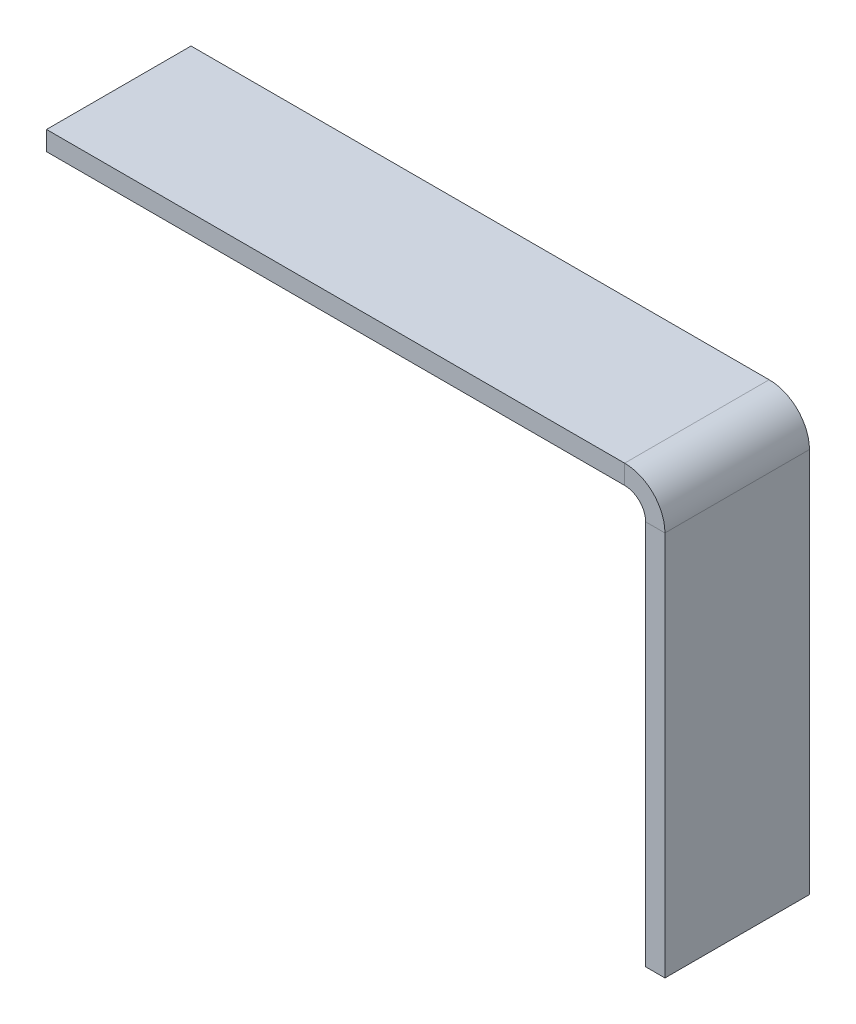
ISO-10303-21;
HEADER;
FILE_DESCRIPTION(('STEP AP214'),'2;1');
FILE_NAME('part.step','',(''),(''),'','','');
FILE_SCHEMA(('AUTOMOTIVE_DESIGN { 1 0 10303 214 1 1 1 1 }'));
ENDSEC;
DATA;
#1=APPLICATION_CONTEXT('core data for automotive mechanical design processes');
#2=APPLICATION_PROTOCOL_DEFINITION('international standard','automotive_design',2000,#1);
#3=PRODUCT_CONTEXT('',#1,'mechanical');
#4=PRODUCT('Part','Part','',(#3));
#5=PRODUCT_RELATED_PRODUCT_CATEGORY('part','',(#4));
#6=PRODUCT_DEFINITION_FORMATION('','',#4);
#7=PRODUCT_DEFINITION_CONTEXT('part definition',#1,'design');
#8=PRODUCT_DEFINITION('design','',#6,#7);
#9=PRODUCT_DEFINITION_SHAPE('','',#8);
#10=(LENGTH_UNIT() NAMED_UNIT(*) SI_UNIT(.MILLI.,.METRE.));
#11=(NAMED_UNIT(*) PLANE_ANGLE_UNIT() SI_UNIT($,.RADIAN.));
#12=(NAMED_UNIT(*) SI_UNIT($,.STERADIAN.) SOLID_ANGLE_UNIT());
#13=UNCERTAINTY_MEASURE_WITH_UNIT(LENGTH_MEASURE(1.E-05),#10,'distance_accuracy_value','');
#14=(GEOMETRIC_REPRESENTATION_CONTEXT(3) GLOBAL_UNCERTAINTY_ASSIGNED_CONTEXT((#13)) GLOBAL_UNIT_ASSIGNED_CONTEXT((#10,
#11,#12)) REPRESENTATION_CONTEXT('',''));
#15=CARTESIAN_POINT('',(0.,0.,0.));
#16=DIRECTION('',(0.,0.,1.));
#17=DIRECTION('',(1.,0.,0.));
#18=AXIS2_PLACEMENT_3D('',#15,#16,#17);
#19=CARTESIAN_POINT('',(0.00928047136647403,-121.697706723207,0.));
#20=DIRECTION('',(-0.999999997139426,-7.56382757487755E-05,0.));
#21=DIRECTION('',(7.56382757487755E-05,-0.999999997139426,0.));
#22=AXIS2_PLACEMENT_3D('',#19,#20,#21);
#23=PLANE('',#22);
#24=DIRECTION('',(-7.56382757487755E-05,0.999999997139426,0.));
#25=VECTOR('',#24,1.);
#26=CARTESIAN_POINT('',(0.00928047136647403,-121.697706723207,15.));
#27=LINE('',#26,#25);
#28=CARTESIAN_POINT('',(7.58099104186671E-05,-0.00453830278984019,15.));
#29=VERTEX_POINT('',#28);
#30=CARTESIAN_POINT('',(-7.54666410751614E-05,1.995461691489,15.));
#31=VERTEX_POINT('',#30);
#32=EDGE_CURVE('E205',#29,#31,#27,.T.);
#33=ORIENTED_EDGE('',*,*,#32,.T.);
#34=DIRECTION('',(0.,0.,1.));
#35=VECTOR('',#34,1.);
#36=CARTESIAN_POINT('',(-7.54666410612836E-05,1.995461691489,0.));
#37=LINE('',#36,#35);
#38=CARTESIAN_POINT('',(-7.54666410751614E-05,1.995461691489,0.));
#39=VERTEX_POINT('',#38);
#40=EDGE_CURVE('E195',#39,#31,#37,.T.);
#41=ORIENTED_EDGE('',*,*,#40,.F.);
#42=DIRECTION('',(-7.56382757487755E-05,0.999999997139426,0.));
#43=VECTOR('',#42,1.);
#44=CARTESIAN_POINT('',(0.00928047136647403,-121.697706723207,0.));
#45=LINE('',#44,#43);
#46=CARTESIAN_POINT('',(7.58099104186671E-05,-0.00453830278984019,0.));
#47=VERTEX_POINT('',#46);
#48=EDGE_CURVE('E103',#47,#39,#45,.T.);
#49=ORIENTED_EDGE('',*,*,#48,.F.);
#50=DIRECTION('',(0.,0.,1.));
#51=VECTOR('',#50,1.);
#52=CARTESIAN_POINT('',(7.58099104186671E-05,-0.00453830278984019,0.));
#53=LINE('',#52,#51);
#54=EDGE_CURVE('E132',#47,#29,#53,.T.);
#55=ORIENTED_EDGE('',*,*,#54,.T.);
#56=EDGE_LOOP('',(#33,#41,#49,#55));
#57=FACE_BOUND('',#56,.T.);
#58=ADVANCED_FACE('F93',(#57),#23,.T.);
#59=CARTESIAN_POINT('',(0.00928047136648791,-121.697706723207,15.));
#60=DIRECTION('',(0.,0.,1.));
#61=DIRECTION('',(0.,1.,0.));
#62=AXIS2_PLACEMENT_3D('',#59,#60,#61);
#63=PLANE('',#62);
#64=DIRECTION('',(-7.56382757487755E-05,0.999999997139426,0.));
#65=VECTOR('',#64,1.);
#66=CARTESIAN_POINT('',(60.009280299732,-121.693168426662,15.));
#67=LINE('',#66,#65);
#68=CARTESIAN_POINT('',(60.000075638276,-6.24490693532098E-09,15.));
#69=VERTEX_POINT('',#68);
#70=CARTESIAN_POINT('',(59.9999243617245,1.99999998803395,15.));
#71=VERTEX_POINT('',#70);
#72=EDGE_CURVE('E187',#69,#71,#67,.T.);
#73=ORIENTED_EDGE('',*,*,#72,.T.);
#74=DIRECTION('',(0.999999997139426,7.56382757487756E-05,0.));
#75=VECTOR('',#74,1.);
#76=CARTESIAN_POINT('',(-7.54666410612836E-05,1.995461691489,15.));
#77=LINE('',#76,#75);
#78=EDGE_CURVE('E182',#31,#71,#77,.T.);
#79=ORIENTED_EDGE('',*,*,#78,.F.);
#80=ORIENTED_EDGE('',*,*,#32,.F.);
#81=DIRECTION('',(0.999999997139426,7.56382757487756E-05,0.));
#82=VECTOR('',#81,1.);
#83=CARTESIAN_POINT('',(7.58099104325449E-05,-0.00453830278984019,15.));
#84=LINE('',#83,#82);
#85=EDGE_CURVE('E197',#29,#69,#84,.T.);
#86=ORIENTED_EDGE('',*,*,#85,.T.);
#87=EDGE_LOOP('',(#73,#79,#80,#86));
#88=FACE_BOUND('',#87,.T.);
#89=ADVANCED_FACE('F200',(#88),#63,.T.);
#90=CARTESIAN_POINT('',(-7.54666410612836E-05,1.995461691489,0.));
#91=DIRECTION('',(-7.56382757487756E-05,0.999999997139426,0.));
#92=DIRECTION('',(0.,0.,1.));
#93=AXIS2_PLACEMENT_3D('',#90,#91,#92);
#94=PLANE('',#93);
#95=ORIENTED_EDGE('',*,*,#78,.T.);
#96=DIRECTION('',(0.,0.,-1.));
#97=VECTOR('',#96,1.);
#98=CARTESIAN_POINT('',(59.9999243617245,1.99999998803393,0.));
#99=LINE('',#98,#97);
#100=CARTESIAN_POINT('',(59.9999243617245,1.99999998803396,0.));
#101=VERTEX_POINT('',#100);
#102=EDGE_CURVE('E174',#71,#101,#99,.T.);
#103=ORIENTED_EDGE('',*,*,#102,.T.);
#104=DIRECTION('',(-0.999999997139426,-7.56382757487756E-05,0.));
#105=VECTOR('',#104,1.);
#106=CARTESIAN_POINT('',(-7.54666410612836E-05,1.995461691489,0.));
#107=LINE('',#106,#105);
#108=EDGE_CURVE('E181',#101,#39,#107,.T.);
#109=ORIENTED_EDGE('',*,*,#108,.T.);
#110=ORIENTED_EDGE('',*,*,#40,.T.);
#111=EDGE_LOOP('',(#95,#103,#109,#110));
#112=FACE_BOUND('',#111,.T.);
#113=ADVANCED_FACE('F193',(#112),#94,.T.);
#114=CARTESIAN_POINT('',(0.00928047136647403,-121.697706723207,0.));
#115=DIRECTION('',(0.,0.,-1.));
#116=DIRECTION('',(0.,-1.,0.));
#117=AXIS2_PLACEMENT_3D('',#114,#115,#116);
#118=PLANE('',#117);
#119=ORIENTED_EDGE('',*,*,#48,.T.);
#120=ORIENTED_EDGE('',*,*,#108,.F.);
#121=DIRECTION('',(-7.56382757487755E-05,0.999999997139426,0.));
#122=VECTOR('',#121,1.);
#123=CARTESIAN_POINT('',(60.009280299732,-121.693168426662,0.));
#124=LINE('',#123,#122);
#125=CARTESIAN_POINT('',(60.000075638276,-6.24490693532098E-09,0.));
#126=VERTEX_POINT('',#125);
#127=EDGE_CURVE('E210',#126,#101,#124,.T.);
#128=ORIENTED_EDGE('',*,*,#127,.F.);
#129=DIRECTION('',(-0.999999997139426,-7.56382757487756E-05,0.));
#130=VECTOR('',#129,1.);
#131=CARTESIAN_POINT('',(7.58099104186671E-05,-0.00453830278984019,0.));
#132=LINE('',#131,#130);
#133=EDGE_CURVE('E13',#126,#47,#132,.T.);
#134=ORIENTED_EDGE('',*,*,#133,.T.);
#135=EDGE_LOOP('',(#119,#120,#128,#134));
#136=FACE_BOUND('',#135,.T.);
#137=ADVANCED_FACE('F223',(#136),#118,.T.);
#138=CARTESIAN_POINT('',(7.58099104186671E-05,-0.00453830278984019,0.));
#139=DIRECTION('',(-7.56382757487756E-05,0.999999997139426,0.));
#140=DIRECTION('',(0.,0.,1.));
#141=AXIS2_PLACEMENT_3D('',#138,#139,#140);
#142=PLANE('',#141);
#143=DIRECTION('',(0.,0.,-1.));
#144=VECTOR('',#143,1.);
#145=CARTESIAN_POINT('',(60.000075638276,-6.24490736900185E-09,0.));
#146=LINE('',#145,#144);
#147=EDGE_CURVE('E97',#69,#126,#146,.T.);
#148=ORIENTED_EDGE('',*,*,#147,.F.);
#149=ORIENTED_EDGE('',*,*,#85,.F.);
#150=ORIENTED_EDGE('',*,*,#54,.F.);
#151=ORIENTED_EDGE('',*,*,#133,.F.);
#152=EDGE_LOOP('',(#148,#149,#150,#151));
#153=FACE_BOUND('',#152,.T.);
#154=ADVANCED_FACE('F95',(#153),#142,.F.);
#155=CARTESIAN_POINT('',(64.1784231260581,62.81721735461,0.));
#156=DIRECTION('',(0.999999997139426,7.56382757452962E-05,0.));
#157=DIRECTION('',(0.,0.,1.));
#158=AXIS2_PLACEMENT_3D('',#155,#156,#157);
#159=PLANE('',#158);
#160=DIRECTION('',(0.,0.,-1.));
#161=VECTOR('',#160,1.);
#162=CARTESIAN_POINT('',(64.1833396139815,-2.18278245945271,0.));
#163=LINE('',#162,#161);
#164=CARTESIAN_POINT('',(64.1833396139815,-2.18278245945271,15.));
#165=VERTEX_POINT('',#164);
#166=CARTESIAN_POINT('',(64.1833396139815,-2.18278245945271,0.));
#167=VERTEX_POINT('',#166);
#168=EDGE_CURVE('E381',#165,#167,#163,.T.);
#169=ORIENTED_EDGE('',*,*,#168,.F.);
#170=DIRECTION('',(7.56382757452962E-05,-0.999999997139426,0.));
#171=VECTOR('',#170,1.);
#172=CARTESIAN_POINT('',(64.1784231260581,62.81721735461,15.));
#173=LINE('',#172,#171);
#174=CARTESIAN_POINT('',(64.1863651450114,-42.1827823450298,15.));
#175=VERTEX_POINT('',#174);
#176=EDGE_CURVE('E140',#165,#175,#173,.T.);
#177=ORIENTED_EDGE('',*,*,#176,.T.);
#178=DIRECTION('',(0.,0.,-1.));
#179=VECTOR('',#178,1.);
#180=CARTESIAN_POINT('',(64.1863651450113,-42.1827823450297,0.));
#181=LINE('',#180,#179);
#182=CARTESIAN_POINT('',(64.1863651450113,-42.1827823450297,0.));
#183=VERTEX_POINT('',#182);
#184=EDGE_CURVE('E384',#175,#183,#181,.T.);
#185=ORIENTED_EDGE('',*,*,#184,.T.);
#186=DIRECTION('',(-7.56382757452962E-05,0.999999997139426,0.));
#187=VECTOR('',#186,1.);
#188=CARTESIAN_POINT('',(64.1784231260581,62.81721735461,0.));
#189=LINE('',#188,#187);
#190=EDGE_CURVE('E386',#183,#167,#189,.T.);
#191=ORIENTED_EDGE('',*,*,#190,.T.);
#192=EDGE_LOOP('',(#169,#177,#185,#191));
#193=FACE_BOUND('',#192,.T.);
#194=ADVANCED_FACE('F229',(#193),#159,.T.);
#195=CARTESIAN_POINT('',(-21.2616140827097,62.8107548174974,15.));
#196=DIRECTION('',(0.,0.,1.));
#197=DIRECTION('',(0.,-1.,0.));
#198=AXIS2_PLACEMENT_3D('',#195,#196,#197);
#199=PLANE('',#198);
#200=DIRECTION('',(0.999999997139426,7.56382757452962E-05,0.));
#201=VECTOR('',#200,1.);
#202=CARTESIAN_POINT('',(-21.2536720637564,-42.1892448821423,15.));
#203=LINE('',#202,#201);
#204=CARTESIAN_POINT('',(62.1863651507325,-42.1829336215812,15.));
#205=VERTEX_POINT('',#204);
#206=EDGE_CURVE('E400',#205,#175,#203,.T.);
#207=ORIENTED_EDGE('',*,*,#206,.T.);
#208=ORIENTED_EDGE('',*,*,#176,.F.);
#209=DIRECTION('',(0.999999997139426,7.56382757452962E-05,0.));
#210=VECTOR('',#209,1.);
#211=CARTESIAN_POINT('',(-21.2566975947862,-2.18924499656528,15.));
#212=LINE('',#211,#210);
#213=CARTESIAN_POINT('',(62.1833396197027,-2.1829337360042,15.));
#214=VERTEX_POINT('',#213);
#215=EDGE_CURVE('E190',#214,#165,#212,.T.);
#216=ORIENTED_EDGE('',*,*,#215,.F.);
#217=DIRECTION('',(7.56382757452962E-05,-0.999999997139426,0.));
#218=VECTOR('',#217,1.);
#219=CARTESIAN_POINT('',(62.1784231317792,62.8170660780585,15.));
#220=LINE('',#219,#218);
#221=EDGE_CURVE('E391',#214,#205,#220,.T.);
#222=ORIENTED_EDGE('',*,*,#221,.T.);
#223=EDGE_LOOP('',(#207,#208,#216,#222));
#224=FACE_BOUND('',#223,.T.);
#225=ADVANCED_FACE('F239',(#224),#199,.T.);
#226=CARTESIAN_POINT('',(-21.2616140827097,62.8107548174974,0.));
#227=DIRECTION('',(0.,0.,-1.));
#228=DIRECTION('',(0.,1.,0.));
#229=AXIS2_PLACEMENT_3D('',#226,#227,#228);
#230=PLANE('',#229);
#231=DIRECTION('',(0.999999997139426,7.56382757452962E-05,0.));
#232=VECTOR('',#231,1.);
#233=CARTESIAN_POINT('',(-21.2566975947862,-2.18924499656528,0.));
#234=LINE('',#233,#232);
#235=CARTESIAN_POINT('',(62.1833396197027,-2.1829337360042,0.));
#236=VERTEX_POINT('',#235);
#237=EDGE_CURVE('E212',#236,#167,#234,.T.);
#238=ORIENTED_EDGE('',*,*,#237,.T.);
#239=ORIENTED_EDGE('',*,*,#190,.F.);
#240=DIRECTION('',(0.999999997139426,7.56382757452962E-05,0.));
#241=VECTOR('',#240,1.);
#242=CARTESIAN_POINT('',(-21.2536720637564,-42.1892448821423,0.));
#243=LINE('',#242,#241);
#244=CARTESIAN_POINT('',(62.1863651507325,-42.1829336215812,0.));
#245=VERTEX_POINT('',#244);
#246=EDGE_CURVE('E215',#245,#183,#243,.T.);
#247=ORIENTED_EDGE('',*,*,#246,.F.);
#248=DIRECTION('',(-7.56382757452962E-05,0.999999997139426,0.));
#249=VECTOR('',#248,1.);
#250=CARTESIAN_POINT('',(62.1784231317792,62.8170660780585,0.));
#251=LINE('',#250,#249);
#252=EDGE_CURVE('E395',#245,#236,#251,.T.);
#253=ORIENTED_EDGE('',*,*,#252,.T.);
#254=EDGE_LOOP('',(#238,#239,#247,#253));
#255=FACE_BOUND('',#254,.T.);
#256=ADVANCED_FACE('F242',(#255),#230,.T.);
#257=CARTESIAN_POINT('',(-21.2536720637564,-42.1892448821423,0.));
#258=DIRECTION('',(7.56382757452962E-05,-0.999999997139426,0.));
#259=DIRECTION('',(0.999999997139426,7.56382757452962E-05,0.));
#260=AXIS2_PLACEMENT_3D('',#257,#258,#259);
#261=PLANE('',#260);
#262=ORIENTED_EDGE('',*,*,#246,.T.);
#263=ORIENTED_EDGE('',*,*,#184,.F.);
#264=ORIENTED_EDGE('',*,*,#206,.F.);
#265=DIRECTION('',(0.,0.,-1.));
#266=VECTOR('',#265,1.);
#267=CARTESIAN_POINT('',(62.1863651507325,-42.1829336215812,0.));
#268=LINE('',#267,#266);
#269=EDGE_CURVE('E398',#205,#245,#268,.T.);
#270=ORIENTED_EDGE('',*,*,#269,.T.);
#271=EDGE_LOOP('',(#262,#263,#264,#270));
#272=FACE_BOUND('',#271,.T.);
#273=ADVANCED_FACE('F246',(#272),#261,.T.);
#274=CARTESIAN_POINT('',(62.1784231317792,62.8170660780585,0.));
#275=DIRECTION('',(0.999999997139426,7.56382757452962E-05,0.));
#276=DIRECTION('',(0.,0.,1.));
#277=AXIS2_PLACEMENT_3D('',#274,#275,#276);
#278=PLANE('',#277);
#279=ORIENTED_EDGE('',*,*,#221,.F.);
#280=DIRECTION('',(0.,0.,-1.));
#281=VECTOR('',#280,1.);
#282=CARTESIAN_POINT('',(62.1833396197027,-2.1829337360042,0.));
#283=LINE('',#282,#281);
#284=EDGE_CURVE('E376',#214,#236,#283,.T.);
#285=ORIENTED_EDGE('',*,*,#284,.T.);
#286=ORIENTED_EDGE('',*,*,#252,.F.);
#287=ORIENTED_EDGE('',*,*,#269,.F.);
#288=EDGE_LOOP('',(#279,#285,#286,#287));
#289=FACE_BOUND('',#288,.T.);
#290=ADVANCED_FACE('F250',(#289),#278,.F.);
#291=CARTESIAN_POINT('',(60.0002407641097,-2.18309886183789,0.));
#292=DIRECTION('',(0.,0.,-1.));
#293=DIRECTION('',(0.,1.,0.));
#294=AXIS2_PLACEMENT_3D('',#291,#292,#293);
#295=PLANE('',#294);
#296=ORIENTED_EDGE('',*,*,#237,.F.);
#297=CARTESIAN_POINT('',(60.0002407641097,-2.18309886183789,0.));
#298=DIRECTION('',(0.,0.,-1.));
#299=DIRECTION('',(-1.,0.,0.));
#300=AXIS2_PLACEMENT_3D('',#297,#298,#299);
#301=CIRCLE('',#300,2.1830988618379);
#302=EDGE_CURVE('E148',#236,#126,#301,.F.);
#303=ORIENTED_EDGE('',*,*,#302,.T.);
#304=ORIENTED_EDGE('',*,*,#127,.T.);
#305=CARTESIAN_POINT('',(60.0002407641097,-2.18309886183789,0.));
#306=DIRECTION('',(0.,0.,-1.));
#307=DIRECTION('',(-1.,0.,0.));
#308=AXIS2_PLACEMENT_3D('',#305,#306,#307);
#309=CIRCLE('',#308,4.18309886183791);
#310=EDGE_CURVE('E126',#167,#101,#309,.F.);
#311=ORIENTED_EDGE('',*,*,#310,.F.);
#312=EDGE_LOOP('',(#296,#303,#304,#311));
#313=FACE_BOUND('',#312,.T.);
#314=ADVANCED_FACE('F254',(#313),#295,.T.);
#315=CARTESIAN_POINT('',(60.0002407641097,-2.18309886183789,15.));
#316=DIRECTION('',(0.,0.,1.));
#317=DIRECTION('',(1.,0.,0.));
#318=AXIS2_PLACEMENT_3D('',#315,#316,#317);
#319=PLANE('',#318);
#320=ORIENTED_EDGE('',*,*,#72,.F.);
#321=CARTESIAN_POINT('',(60.0002407641097,-2.18309886183789,15.));
#322=DIRECTION('',(0.,0.,-1.));
#323=DIRECTION('',(-1.,0.,0.));
#324=AXIS2_PLACEMENT_3D('',#321,#322,#323);
#325=CIRCLE('',#324,2.1830988618379);
#326=EDGE_CURVE('E374',#69,#214,#325,.T.);
#327=ORIENTED_EDGE('',*,*,#326,.T.);
#328=ORIENTED_EDGE('',*,*,#215,.T.);
#329=CARTESIAN_POINT('',(60.0002407641097,-2.18309886183789,15.));
#330=DIRECTION('',(0.,0.,-1.));
#331=DIRECTION('',(-1.,0.,0.));
#332=AXIS2_PLACEMENT_3D('',#329,#330,#331);
#333=CIRCLE('',#332,4.18309886183791);
#334=EDGE_CURVE('E177',#71,#165,#333,.T.);
#335=ORIENTED_EDGE('',*,*,#334,.F.);
#336=EDGE_LOOP('',(#320,#327,#328,#335));
#337=FACE_BOUND('',#336,.T.);
#338=ADVANCED_FACE('F185',(#337),#319,.T.);
#339=CARTESIAN_POINT('',(60.0002407641097,-2.18309886183789,121.085171141642));
#340=DIRECTION('',(0.,0.,-1.));
#341=DIRECTION('',(-1.,0.,0.));
#342=AXIS2_PLACEMENT_3D('',#339,#340,#341);
#343=CYLINDRICAL_SURFACE('',#342,4.18309886183791);
#344=ORIENTED_EDGE('',*,*,#334,.T.);
#345=ORIENTED_EDGE('',*,*,#168,.T.);
#346=ORIENTED_EDGE('',*,*,#310,.T.);
#347=ORIENTED_EDGE('',*,*,#102,.F.);
#348=EDGE_LOOP('',(#344,#345,#346,#347));
#349=FACE_BOUND('',#348,.T.);
#350=ADVANCED_FACE('F176',(#349),#343,.T.);
#351=CARTESIAN_POINT('',(60.0002407641097,-2.18309886183789,121.085171141642));
#352=DIRECTION('',(0.,0.,-1.));
#353=DIRECTION('',(-1.,0.,0.));
#354=AXIS2_PLACEMENT_3D('',#351,#352,#353);
#355=CYLINDRICAL_SURFACE('',#354,2.1830988618379);
#356=ORIENTED_EDGE('',*,*,#326,.F.);
#357=ORIENTED_EDGE('',*,*,#147,.T.);
#358=ORIENTED_EDGE('',*,*,#302,.F.);
#359=ORIENTED_EDGE('',*,*,#284,.F.);
#360=EDGE_LOOP('',(#356,#357,#358,#359));
#361=FACE_BOUND('',#360,.T.);
#362=ADVANCED_FACE('F262',(#361),#355,.F.);
#363=CLOSED_SHELL('',(#58,#89,#113,#137,#154,#194,#225,#256,#273,#290,#314,#338,#350,#362));
#364=MANIFOLD_SOLID_BREP('B2',#363);
#365=ADVANCED_BREP_SHAPE_REPRESENTATION('',(#18,#364),#14);
#366=SHAPE_DEFINITION_REPRESENTATION(#9,#365);
ENDSEC;
END-ISO-10303-21;
